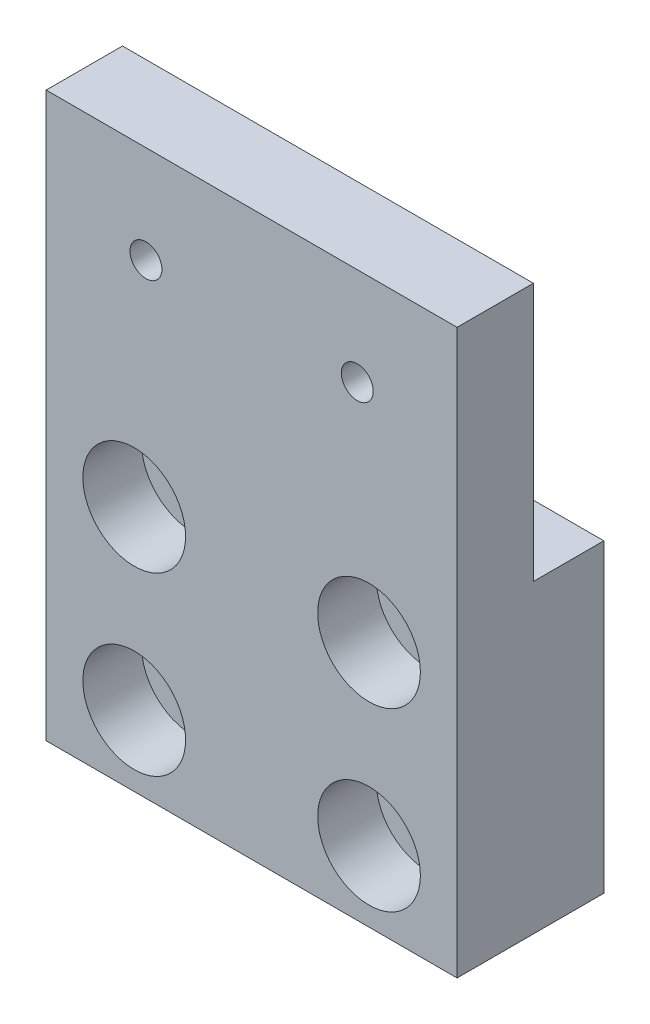
ISO-10303-21;
HEADER;
FILE_DESCRIPTION(('STEP AP214'),'2;1');
FILE_NAME('part.step','',(''),(''),'','','');
FILE_SCHEMA(('AUTOMOTIVE_DESIGN { 1 0 10303 214 1 1 1 1 }'));
ENDSEC;
DATA;
#1=APPLICATION_CONTEXT('core data for automotive mechanical design processes');
#2=APPLICATION_PROTOCOL_DEFINITION('international standard','automotive_design',2000,#1);
#3=PRODUCT_CONTEXT('',#1,'mechanical');
#4=PRODUCT('Part','Part','',(#3));
#5=PRODUCT_RELATED_PRODUCT_CATEGORY('part','',(#4));
#6=PRODUCT_DEFINITION_FORMATION('','',#4);
#7=PRODUCT_DEFINITION_CONTEXT('part definition',#1,'design');
#8=PRODUCT_DEFINITION('design','',#6,#7);
#9=PRODUCT_DEFINITION_SHAPE('','',#8);
#10=(LENGTH_UNIT() NAMED_UNIT(*) SI_UNIT(.MILLI.,.METRE.));
#11=(NAMED_UNIT(*) PLANE_ANGLE_UNIT() SI_UNIT($,.RADIAN.));
#12=(NAMED_UNIT(*) SI_UNIT($,.STERADIAN.) SOLID_ANGLE_UNIT());
#13=UNCERTAINTY_MEASURE_WITH_UNIT(LENGTH_MEASURE(1.E-05),#10,'distance_accuracy_value','');
#14=(GEOMETRIC_REPRESENTATION_CONTEXT(3) GLOBAL_UNCERTAINTY_ASSIGNED_CONTEXT((#13)) GLOBAL_UNIT_ASSIGNED_CONTEXT((#10,
#11,#12)) REPRESENTATION_CONTEXT('',''));
#15=CARTESIAN_POINT('',(0.,0.,0.));
#16=DIRECTION('',(0.,0.,1.));
#17=DIRECTION('',(1.,0.,0.));
#18=AXIS2_PLACEMENT_3D('',#15,#16,#17);
#19=CARTESIAN_POINT('',(-22.225,30.48,7.9375));
#20=DIRECTION('',(1.,0.,0.));
#21=DIRECTION('',(0.,1.,0.));
#22=AXIS2_PLACEMENT_3D('',#19,#20,#21);
#23=PLANE('',#22);
#24=DIRECTION('',(0.,-1.,0.));
#25=VECTOR('',#24,1.);
#26=CARTESIAN_POINT('',(-22.225,30.48,-0.317500000000002));
#27=LINE('',#26,#25);
#28=CARTESIAN_POINT('',(-22.225,30.48,-0.317500000000002));
#29=VERTEX_POINT('',#28);
#30=CARTESIAN_POINT('',(-22.225,2.53999999999998,-0.317500000000006));
#31=VERTEX_POINT('',#30);
#32=EDGE_CURVE('E94',#29,#31,#27,.T.);
#33=ORIENTED_EDGE('',*,*,#32,.T.);
#34=DIRECTION('',(0.,0.,-1.));
#35=VECTOR('',#34,1.);
#36=CARTESIAN_POINT('',(-22.225,2.53999999999998,-7.93750000000001));
#37=LINE('',#36,#35);
#38=CARTESIAN_POINT('',(-22.225,2.53999999999998,-7.93750000000001));
#39=VERTEX_POINT('',#38);
#40=EDGE_CURVE('E105',#31,#39,#37,.T.);
#41=ORIENTED_EDGE('',*,*,#40,.T.);
#42=DIRECTION('',(0.,-1.,0.));
#43=VECTOR('',#42,1.);
#44=CARTESIAN_POINT('',(-22.225,30.48,-7.9375));
#45=LINE('',#44,#43);
#46=CARTESIAN_POINT('',(-22.225,-30.48,-7.9375));
#47=VERTEX_POINT('',#46);
#48=EDGE_CURVE('E193',#39,#47,#45,.T.);
#49=ORIENTED_EDGE('',*,*,#48,.T.);
#50=DIRECTION('',(0.,0.,-1.));
#51=VECTOR('',#50,1.);
#52=CARTESIAN_POINT('',(-22.225,-30.48,7.9375));
#53=LINE('',#52,#51);
#54=CARTESIAN_POINT('',(-22.225,-30.48,7.9375));
#55=VERTEX_POINT('',#54);
#56=EDGE_CURVE('E11',#55,#47,#53,.T.);
#57=ORIENTED_EDGE('',*,*,#56,.F.);
#58=DIRECTION('',(0.,-1.,0.));
#59=VECTOR('',#58,1.);
#60=CARTESIAN_POINT('',(-22.225,30.48,7.9375));
#61=LINE('',#60,#59);
#62=CARTESIAN_POINT('',(-22.225,30.48,7.9375));
#63=VERTEX_POINT('',#62);
#64=EDGE_CURVE('E116',#63,#55,#61,.T.);
#65=ORIENTED_EDGE('',*,*,#64,.F.);
#66=DIRECTION('',(0.,0.,-1.));
#67=VECTOR('',#66,1.);
#68=CARTESIAN_POINT('',(-22.225,30.48,7.9375));
#69=LINE('',#68,#67);
#70=EDGE_CURVE('E110',#63,#29,#69,.T.);
#71=ORIENTED_EDGE('',*,*,#70,.T.);
#72=EDGE_LOOP('',(#33,#41,#49,#57,#65,#71));
#73=FACE_BOUND('',#72,.T.);
#74=ADVANCED_FACE('F34',(#73),#23,.F.);
#75=CARTESIAN_POINT('',(-22.225,-30.48,7.9375));
#76=DIRECTION('',(0.,1.,0.));
#77=DIRECTION('',(0.,0.,1.));
#78=AXIS2_PLACEMENT_3D('',#75,#76,#77);
#79=PLANE('',#78);
#80=DIRECTION('',(1.,0.,0.));
#81=VECTOR('',#80,1.);
#82=CARTESIAN_POINT('',(-22.225,-30.48,-7.9375));
#83=LINE('',#82,#81);
#84=CARTESIAN_POINT('',(22.225,-30.48,-7.9375));
#85=VERTEX_POINT('',#84);
#86=EDGE_CURVE('E74',#47,#85,#83,.T.);
#87=ORIENTED_EDGE('',*,*,#86,.T.);
#88=DIRECTION('',(0.,0.,-1.));
#89=VECTOR('',#88,1.);
#90=CARTESIAN_POINT('',(22.225,-30.48,7.9375));
#91=LINE('',#90,#89);
#92=CARTESIAN_POINT('',(22.225,-30.48,7.9375));
#93=VERTEX_POINT('',#92);
#94=EDGE_CURVE('E42',#93,#85,#91,.T.);
#95=ORIENTED_EDGE('',*,*,#94,.F.);
#96=DIRECTION('',(1.,0.,0.));
#97=VECTOR('',#96,1.);
#98=CARTESIAN_POINT('',(-22.225,-30.48,7.9375));
#99=LINE('',#98,#97);
#100=EDGE_CURVE('E79',#55,#93,#99,.T.);
#101=ORIENTED_EDGE('',*,*,#100,.F.);
#102=ORIENTED_EDGE('',*,*,#56,.T.);
#103=EDGE_LOOP('',(#87,#95,#101,#102));
#104=FACE_BOUND('',#103,.T.);
#105=ADVANCED_FACE('F206',(#104),#79,.F.);
#106=CARTESIAN_POINT('',(22.225,30.48,7.9375));
#107=DIRECTION('',(-1.,0.,0.));
#108=DIRECTION('',(0.,-1.,0.));
#109=AXIS2_PLACEMENT_3D('',#106,#107,#108);
#110=PLANE('',#109);
#111=DIRECTION('',(0.,1.,0.));
#112=VECTOR('',#111,1.);
#113=CARTESIAN_POINT('',(22.225,30.48,-7.9375));
#114=LINE('',#113,#112);
#115=CARTESIAN_POINT('',(22.225,2.54,-7.9375));
#116=VERTEX_POINT('',#115);
#117=EDGE_CURVE('E122',#85,#116,#114,.T.);
#118=ORIENTED_EDGE('',*,*,#117,.T.);
#119=DIRECTION('',(0.,0.,-1.));
#120=VECTOR('',#119,1.);
#121=CARTESIAN_POINT('',(22.225,2.53999999999999,-7.93750000000001));
#122=LINE('',#121,#120);
#123=CARTESIAN_POINT('',(22.225,2.53999999999999,-0.317500000000006));
#124=VERTEX_POINT('',#123);
#125=EDGE_CURVE('E50',#124,#116,#122,.T.);
#126=ORIENTED_EDGE('',*,*,#125,.F.);
#127=DIRECTION('',(0.,-1.,0.));
#128=VECTOR('',#127,1.);
#129=CARTESIAN_POINT('',(22.225,30.48,-0.317500000000002));
#130=LINE('',#129,#128);
#131=CARTESIAN_POINT('',(22.225,30.48,-0.317500000000002));
#132=VERTEX_POINT('',#131);
#133=EDGE_CURVE('E127',#132,#124,#130,.T.);
#134=ORIENTED_EDGE('',*,*,#133,.F.);
#135=DIRECTION('',(0.,0.,-1.));
#136=VECTOR('',#135,1.);
#137=CARTESIAN_POINT('',(22.225,30.48,7.9375));
#138=LINE('',#137,#136);
#139=CARTESIAN_POINT('',(22.225,30.48,7.9375));
#140=VERTEX_POINT('',#139);
#141=EDGE_CURVE('E113',#140,#132,#138,.T.);
#142=ORIENTED_EDGE('',*,*,#141,.F.);
#143=DIRECTION('',(0.,1.,0.));
#144=VECTOR('',#143,1.);
#145=CARTESIAN_POINT('',(22.225,30.48,7.9375));
#146=LINE('',#145,#144);
#147=EDGE_CURVE('E119',#93,#140,#146,.T.);
#148=ORIENTED_EDGE('',*,*,#147,.F.);
#149=ORIENTED_EDGE('',*,*,#94,.T.);
#150=EDGE_LOOP('',(#118,#126,#134,#142,#148,#149));
#151=FACE_BOUND('',#150,.T.);
#152=ADVANCED_FACE('F200',(#151),#110,.F.);
#153=CARTESIAN_POINT('',(-22.225,30.48,7.9375));
#154=DIRECTION('',(0.,-1.,0.));
#155=DIRECTION('',(0.,0.,-1.));
#156=AXIS2_PLACEMENT_3D('',#153,#154,#155);
#157=PLANE('',#156);
#158=ORIENTED_EDGE('',*,*,#141,.T.);
#159=DIRECTION('',(1.,0.,0.));
#160=VECTOR('',#159,1.);
#161=CARTESIAN_POINT('',(-22.225,30.48,-0.317500000000002));
#162=LINE('',#161,#160);
#163=EDGE_CURVE('E98',#29,#132,#162,.T.);
#164=ORIENTED_EDGE('',*,*,#163,.F.);
#165=ORIENTED_EDGE('',*,*,#70,.F.);
#166=DIRECTION('',(-1.,0.,0.));
#167=VECTOR('',#166,1.);
#168=CARTESIAN_POINT('',(-22.225,30.48,7.9375));
#169=LINE('',#168,#167);
#170=EDGE_CURVE('E59',#140,#63,#169,.T.);
#171=ORIENTED_EDGE('',*,*,#170,.F.);
#172=EDGE_LOOP('',(#158,#164,#165,#171));
#173=FACE_BOUND('',#172,.T.);
#174=ADVANCED_FACE('F109',(#173),#157,.F.);
#175=CARTESIAN_POINT('',(0.,0.,7.9375));
#176=DIRECTION('',(0.,0.,1.));
#177=DIRECTION('',(1.,0.,0.));
#178=AXIS2_PLACEMENT_3D('',#175,#176,#177);
#179=PLANE('',#178);
#180=CARTESIAN_POINT('',(-11.43,19.939,7.9375));
#181=DIRECTION('',(0.,0.,1.));
#182=DIRECTION('',(1.,0.,0.));
#183=AXIS2_PLACEMENT_3D('',#180,#181,#182);
#184=CIRCLE('',#183,1.72719999999999);
#185=CARTESIAN_POINT('',(-9.70280000000001,19.939,7.9375));
#186=VERTEX_POINT('',#185);
#187=EDGE_CURVE('E137',#186,#186,#184,.T.);
#188=ORIENTED_EDGE('',*,*,#187,.F.);
#189=EDGE_LOOP('',(#188));
#190=FACE_BOUND('',#189,.T.);
#191=CARTESIAN_POINT('',(11.43,19.939,7.9375));
#192=DIRECTION('',(0.,0.,1.));
#193=DIRECTION('',(1.,0.,0.));
#194=AXIS2_PLACEMENT_3D('',#191,#192,#193);
#195=CIRCLE('',#194,1.72719999999999);
#196=CARTESIAN_POINT('',(13.1572,19.939,7.9375));
#197=VERTEX_POINT('',#196);
#198=EDGE_CURVE('E128',#197,#197,#195,.T.);
#199=ORIENTED_EDGE('',*,*,#198,.F.);
#200=EDGE_LOOP('',(#199));
#201=FACE_BOUND('',#200,.T.);
#202=CARTESIAN_POINT('',(-12.7,-3.81,7.9375));
#203=DIRECTION('',(0.,0.,1.));
#204=DIRECTION('',(1.,0.,0.));
#205=AXIS2_PLACEMENT_3D('',#202,#203,#204);
#206=CIRCLE('',#205,5.55625);
#207=CARTESIAN_POINT('',(-7.14375,-3.81,7.9375));
#208=VERTEX_POINT('',#207);
#209=EDGE_CURVE('E144',#208,#208,#206,.T.);
#210=ORIENTED_EDGE('',*,*,#209,.F.);
#211=EDGE_LOOP('',(#210));
#212=FACE_BOUND('',#211,.T.);
#213=CARTESIAN_POINT('',(12.7,-3.81,7.9375));
#214=DIRECTION('',(0.,0.,1.));
#215=DIRECTION('',(1.,0.,0.));
#216=AXIS2_PLACEMENT_3D('',#213,#214,#215);
#217=CIRCLE('',#216,5.55625);
#218=CARTESIAN_POINT('',(18.25625,-3.81,7.9375));
#219=VERTEX_POINT('',#218);
#220=EDGE_CURVE('E157',#219,#219,#217,.T.);
#221=ORIENTED_EDGE('',*,*,#220,.F.);
#222=EDGE_LOOP('',(#221));
#223=FACE_BOUND('',#222,.T.);
#224=CARTESIAN_POINT('',(12.7,-22.86,7.9375));
#225=DIRECTION('',(0.,0.,1.));
#226=DIRECTION('',(1.,0.,0.));
#227=AXIS2_PLACEMENT_3D('',#224,#225,#226);
#228=CIRCLE('',#227,5.55625);
#229=CARTESIAN_POINT('',(18.25625,-22.86,7.9375));
#230=VERTEX_POINT('',#229);
#231=EDGE_CURVE('E169',#230,#230,#228,.T.);
#232=ORIENTED_EDGE('',*,*,#231,.F.);
#233=EDGE_LOOP('',(#232));
#234=FACE_BOUND('',#233,.T.);
#235=CARTESIAN_POINT('',(-12.7,-22.86,7.9375));
#236=DIRECTION('',(0.,0.,1.));
#237=DIRECTION('',(1.,0.,0.));
#238=AXIS2_PLACEMENT_3D('',#235,#236,#237);
#239=CIRCLE('',#238,5.55625);
#240=CARTESIAN_POINT('',(-7.14375,-22.86,7.9375));
#241=VERTEX_POINT('',#240);
#242=EDGE_CURVE('E181',#241,#241,#239,.T.);
#243=ORIENTED_EDGE('',*,*,#242,.F.);
#244=EDGE_LOOP('',(#243));
#245=FACE_BOUND('',#244,.T.);
#246=ORIENTED_EDGE('',*,*,#64,.T.);
#247=ORIENTED_EDGE('',*,*,#100,.T.);
#248=ORIENTED_EDGE('',*,*,#147,.T.);
#249=ORIENTED_EDGE('',*,*,#170,.T.);
#250=EDGE_LOOP('',(#246,#247,#248,#249));
#251=FACE_BOUND('',#250,.T.);
#252=ADVANCED_FACE('F216',(#190,#201,#212,#223,#234,#245,#251),#179,.T.);
#253=CARTESIAN_POINT('',(0.,0.,-7.9375));
#254=DIRECTION('',(0.,0.,1.));
#255=DIRECTION('',(1.,0.,0.));
#256=AXIS2_PLACEMENT_3D('',#253,#254,#255);
#257=PLANE('',#256);
#258=CARTESIAN_POINT('',(-12.7,-3.81,-7.9375));
#259=DIRECTION('',(0.,0.,1.));
#260=DIRECTION('',(1.,0.,0.));
#261=AXIS2_PLACEMENT_3D('',#258,#259,#260);
#262=CIRCLE('',#261,3.3782);
#263=CARTESIAN_POINT('',(-9.3218,-3.81,-7.9375));
#264=VERTEX_POINT('',#263);
#265=EDGE_CURVE('E154',#264,#264,#262,.T.);
#266=ORIENTED_EDGE('',*,*,#265,.T.);
#267=EDGE_LOOP('',(#266));
#268=FACE_BOUND('',#267,.T.);
#269=CARTESIAN_POINT('',(12.7,-3.81,-7.9375));
#270=DIRECTION('',(0.,0.,1.));
#271=DIRECTION('',(1.,0.,0.));
#272=AXIS2_PLACEMENT_3D('',#269,#270,#271);
#273=CIRCLE('',#272,3.3782);
#274=CARTESIAN_POINT('',(16.0782,-3.81,-7.9375));
#275=VERTEX_POINT('',#274);
#276=EDGE_CURVE('E166',#275,#275,#273,.T.);
#277=ORIENTED_EDGE('',*,*,#276,.T.);
#278=EDGE_LOOP('',(#277));
#279=FACE_BOUND('',#278,.T.);
#280=CARTESIAN_POINT('',(12.7,-22.86,-7.9375));
#281=DIRECTION('',(0.,0.,1.));
#282=DIRECTION('',(1.,0.,0.));
#283=AXIS2_PLACEMENT_3D('',#280,#281,#282);
#284=CIRCLE('',#283,3.3782);
#285=CARTESIAN_POINT('',(16.0782,-22.86,-7.9375));
#286=VERTEX_POINT('',#285);
#287=EDGE_CURVE('E178',#286,#286,#284,.T.);
#288=ORIENTED_EDGE('',*,*,#287,.T.);
#289=EDGE_LOOP('',(#288));
#290=FACE_BOUND('',#289,.T.);
#291=CARTESIAN_POINT('',(-12.7,-22.86,-7.9375));
#292=DIRECTION('',(0.,0.,1.));
#293=DIRECTION('',(1.,0.,0.));
#294=AXIS2_PLACEMENT_3D('',#291,#292,#293);
#295=CIRCLE('',#294,3.3782);
#296=CARTESIAN_POINT('',(-9.32179999999999,-22.86,-7.9375));
#297=VERTEX_POINT('',#296);
#298=EDGE_CURVE('E190',#297,#297,#295,.T.);
#299=ORIENTED_EDGE('',*,*,#298,.T.);
#300=EDGE_LOOP('',(#299));
#301=FACE_BOUND('',#300,.T.);
#302=ORIENTED_EDGE('',*,*,#48,.F.);
#303=DIRECTION('',(1.,0.,0.));
#304=VECTOR('',#303,1.);
#305=CARTESIAN_POINT('',(-22.225,2.53999999999998,-7.93750000000001));
#306=LINE('',#305,#304);
#307=EDGE_CURVE('E142',#39,#116,#306,.T.);
#308=ORIENTED_EDGE('',*,*,#307,.T.);
#309=ORIENTED_EDGE('',*,*,#117,.F.);
#310=ORIENTED_EDGE('',*,*,#86,.F.);
#311=EDGE_LOOP('',(#302,#308,#309,#310));
#312=FACE_BOUND('',#311,.T.);
#313=ADVANCED_FACE('F204',(#268,#279,#290,#301,#312),#257,.F.);
#314=CARTESIAN_POINT('',(-12.7,-22.86,7.9375));
#315=DIRECTION('',(0.,0.,1.));
#316=DIRECTION('',(1.,0.,0.));
#317=AXIS2_PLACEMENT_3D('',#314,#315,#316);
#318=CYLINDRICAL_SURFACE('',#317,3.3782);
#319=ORIENTED_EDGE('',*,*,#298,.F.);
#320=EDGE_LOOP('',(#319));
#321=FACE_BOUND('',#320,.T.);
#322=CARTESIAN_POINT('',(-12.7,-22.86,1.5875));
#323=DIRECTION('',(0.,0.,1.));
#324=DIRECTION('',(1.,0.,0.));
#325=AXIS2_PLACEMENT_3D('',#322,#323,#324);
#326=CIRCLE('',#325,3.37820000000001);
#327=CARTESIAN_POINT('',(-9.32179999999999,-22.86,1.5875));
#328=VERTEX_POINT('',#327);
#329=EDGE_CURVE('E187',#328,#328,#326,.T.);
#330=ORIENTED_EDGE('',*,*,#329,.T.);
#331=EDGE_LOOP('',(#330));
#332=FACE_BOUND('',#331,.T.);
#333=ADVANCED_FACE('F219',(#321,#332),#318,.F.);
#334=CARTESIAN_POINT('',(-9.32179999999999,-22.86,1.5875));
#335=DIRECTION('',(0.,0.,-1.));
#336=DIRECTION('',(-1.,0.,0.));
#337=AXIS2_PLACEMENT_3D('',#334,#335,#336);
#338=PLANE('',#337);
#339=ORIENTED_EDGE('',*,*,#329,.F.);
#340=EDGE_LOOP('',(#339));
#341=FACE_BOUND('',#340,.T.);
#342=CARTESIAN_POINT('',(-12.7,-22.86,1.5875));
#343=DIRECTION('',(0.,0.,1.));
#344=DIRECTION('',(1.,0.,0.));
#345=AXIS2_PLACEMENT_3D('',#342,#343,#344);
#346=CIRCLE('',#345,5.55625);
#347=CARTESIAN_POINT('',(-7.14375,-22.86,1.5875));
#348=VERTEX_POINT('',#347);
#349=EDGE_CURVE('E184',#348,#348,#346,.T.);
#350=ORIENTED_EDGE('',*,*,#349,.T.);
#351=EDGE_LOOP('',(#350));
#352=FACE_BOUND('',#351,.T.);
#353=ADVANCED_FACE('F226',(#341,#352),#338,.F.);
#354=CARTESIAN_POINT('',(-12.7,-22.86,7.9375));
#355=DIRECTION('',(0.,0.,1.));
#356=DIRECTION('',(1.,0.,0.));
#357=AXIS2_PLACEMENT_3D('',#354,#355,#356);
#358=CYLINDRICAL_SURFACE('',#357,5.55625);
#359=ORIENTED_EDGE('',*,*,#349,.F.);
#360=EDGE_LOOP('',(#359));
#361=FACE_BOUND('',#360,.T.);
#362=ORIENTED_EDGE('',*,*,#242,.T.);
#363=EDGE_LOOP('',(#362));
#364=FACE_BOUND('',#363,.T.);
#365=ADVANCED_FACE('F230',(#361,#364),#358,.F.);
#366=CARTESIAN_POINT('',(12.7,-22.86,7.9375));
#367=DIRECTION('',(0.,0.,1.));
#368=DIRECTION('',(1.,0.,0.));
#369=AXIS2_PLACEMENT_3D('',#366,#367,#368);
#370=CYLINDRICAL_SURFACE('',#369,3.37820000000001);
#371=ORIENTED_EDGE('',*,*,#287,.F.);
#372=EDGE_LOOP('',(#371));
#373=FACE_BOUND('',#372,.T.);
#374=CARTESIAN_POINT('',(12.7,-22.86,1.5875));
#375=DIRECTION('',(0.,0.,1.));
#376=DIRECTION('',(1.,0.,0.));
#377=AXIS2_PLACEMENT_3D('',#374,#375,#376);
#378=CIRCLE('',#377,3.37820000000001);
#379=CARTESIAN_POINT('',(16.0782,-22.86,1.5875));
#380=VERTEX_POINT('',#379);
#381=EDGE_CURVE('E175',#380,#380,#378,.T.);
#382=ORIENTED_EDGE('',*,*,#381,.T.);
#383=EDGE_LOOP('',(#382));
#384=FACE_BOUND('',#383,.T.);
#385=ADVANCED_FACE('F234',(#373,#384),#370,.F.);
#386=CARTESIAN_POINT('',(16.0782,-22.86,1.5875));
#387=DIRECTION('',(0.,0.,-1.));
#388=DIRECTION('',(-1.,0.,0.));
#389=AXIS2_PLACEMENT_3D('',#386,#387,#388);
#390=PLANE('',#389);
#391=ORIENTED_EDGE('',*,*,#381,.F.);
#392=EDGE_LOOP('',(#391));
#393=FACE_BOUND('',#392,.T.);
#394=CARTESIAN_POINT('',(12.7,-22.86,1.5875));
#395=DIRECTION('',(0.,0.,1.));
#396=DIRECTION('',(1.,0.,0.));
#397=AXIS2_PLACEMENT_3D('',#394,#395,#396);
#398=CIRCLE('',#397,5.55625);
#399=CARTESIAN_POINT('',(18.25625,-22.86,1.5875));
#400=VERTEX_POINT('',#399);
#401=EDGE_CURVE('E172',#400,#400,#398,.T.);
#402=ORIENTED_EDGE('',*,*,#401,.T.);
#403=EDGE_LOOP('',(#402));
#404=FACE_BOUND('',#403,.T.);
#405=ADVANCED_FACE('F238',(#393,#404),#390,.F.);
#406=CARTESIAN_POINT('',(12.7,-22.86,7.9375));
#407=DIRECTION('',(0.,0.,1.));
#408=DIRECTION('',(1.,0.,0.));
#409=AXIS2_PLACEMENT_3D('',#406,#407,#408);
#410=CYLINDRICAL_SURFACE('',#409,5.55625);
#411=ORIENTED_EDGE('',*,*,#401,.F.);
#412=EDGE_LOOP('',(#411));
#413=FACE_BOUND('',#412,.T.);
#414=ORIENTED_EDGE('',*,*,#231,.T.);
#415=EDGE_LOOP('',(#414));
#416=FACE_BOUND('',#415,.T.);
#417=ADVANCED_FACE('F242',(#413,#416),#410,.F.);
#418=CARTESIAN_POINT('',(12.7,-3.81,7.9375));
#419=DIRECTION('',(0.,0.,1.));
#420=DIRECTION('',(1.,0.,0.));
#421=AXIS2_PLACEMENT_3D('',#418,#419,#420);
#422=CYLINDRICAL_SURFACE('',#421,3.37820000000001);
#423=ORIENTED_EDGE('',*,*,#276,.F.);
#424=EDGE_LOOP('',(#423));
#425=FACE_BOUND('',#424,.T.);
#426=CARTESIAN_POINT('',(12.7,-3.81,1.5875));
#427=DIRECTION('',(0.,0.,1.));
#428=DIRECTION('',(1.,0.,0.));
#429=AXIS2_PLACEMENT_3D('',#426,#427,#428);
#430=CIRCLE('',#429,3.37820000000001);
#431=CARTESIAN_POINT('',(16.0782,-3.81,1.5875));
#432=VERTEX_POINT('',#431);
#433=EDGE_CURVE('E163',#432,#432,#430,.T.);
#434=ORIENTED_EDGE('',*,*,#433,.T.);
#435=EDGE_LOOP('',(#434));
#436=FACE_BOUND('',#435,.T.);
#437=ADVANCED_FACE('F246',(#425,#436),#422,.F.);
#438=CARTESIAN_POINT('',(16.0782,-3.81,1.5875));
#439=DIRECTION('',(0.,0.,-1.));
#440=DIRECTION('',(-1.,0.,0.));
#441=AXIS2_PLACEMENT_3D('',#438,#439,#440);
#442=PLANE('',#441);
#443=ORIENTED_EDGE('',*,*,#433,.F.);
#444=EDGE_LOOP('',(#443));
#445=FACE_BOUND('',#444,.T.);
#446=CARTESIAN_POINT('',(12.7,-3.81,1.5875));
#447=DIRECTION('',(0.,0.,1.));
#448=DIRECTION('',(1.,0.,0.));
#449=AXIS2_PLACEMENT_3D('',#446,#447,#448);
#450=CIRCLE('',#449,5.55625);
#451=CARTESIAN_POINT('',(18.25625,-3.81,1.5875));
#452=VERTEX_POINT('',#451);
#453=EDGE_CURVE('E160',#452,#452,#450,.T.);
#454=ORIENTED_EDGE('',*,*,#453,.T.);
#455=EDGE_LOOP('',(#454));
#456=FACE_BOUND('',#455,.T.);
#457=ADVANCED_FACE('F250',(#445,#456),#442,.F.);
#458=CARTESIAN_POINT('',(12.7,-3.81,7.9375));
#459=DIRECTION('',(0.,0.,1.));
#460=DIRECTION('',(1.,0.,0.));
#461=AXIS2_PLACEMENT_3D('',#458,#459,#460);
#462=CYLINDRICAL_SURFACE('',#461,5.55625);
#463=ORIENTED_EDGE('',*,*,#453,.F.);
#464=EDGE_LOOP('',(#463));
#465=FACE_BOUND('',#464,.T.);
#466=ORIENTED_EDGE('',*,*,#220,.T.);
#467=EDGE_LOOP('',(#466));
#468=FACE_BOUND('',#467,.T.);
#469=ADVANCED_FACE('F254',(#465,#468),#462,.F.);
#470=CARTESIAN_POINT('',(-12.7,-3.81,7.9375));
#471=DIRECTION('',(0.,0.,1.));
#472=DIRECTION('',(1.,0.,0.));
#473=AXIS2_PLACEMENT_3D('',#470,#471,#472);
#474=CYLINDRICAL_SURFACE('',#473,3.3782);
#475=ORIENTED_EDGE('',*,*,#265,.F.);
#476=EDGE_LOOP('',(#475));
#477=FACE_BOUND('',#476,.T.);
#478=CARTESIAN_POINT('',(-12.7,-3.81,1.5875));
#479=DIRECTION('',(0.,0.,1.));
#480=DIRECTION('',(1.,0.,0.));
#481=AXIS2_PLACEMENT_3D('',#478,#479,#480);
#482=CIRCLE('',#481,3.37820000000001);
#483=CARTESIAN_POINT('',(-9.32179999999999,-3.81,1.5875));
#484=VERTEX_POINT('',#483);
#485=EDGE_CURVE('E151',#484,#484,#482,.T.);
#486=ORIENTED_EDGE('',*,*,#485,.T.);
#487=EDGE_LOOP('',(#486));
#488=FACE_BOUND('',#487,.T.);
#489=ADVANCED_FACE('F258',(#477,#488),#474,.F.);
#490=CARTESIAN_POINT('',(-9.32179999999999,-3.81,1.5875));
#491=DIRECTION('',(0.,0.,-1.));
#492=DIRECTION('',(-1.,0.,0.));
#493=AXIS2_PLACEMENT_3D('',#490,#491,#492);
#494=PLANE('',#493);
#495=ORIENTED_EDGE('',*,*,#485,.F.);
#496=EDGE_LOOP('',(#495));
#497=FACE_BOUND('',#496,.T.);
#498=CARTESIAN_POINT('',(-12.7,-3.81,1.5875));
#499=DIRECTION('',(0.,0.,1.));
#500=DIRECTION('',(1.,0.,0.));
#501=AXIS2_PLACEMENT_3D('',#498,#499,#500);
#502=CIRCLE('',#501,5.55625);
#503=CARTESIAN_POINT('',(-7.14375,-3.81,1.5875));
#504=VERTEX_POINT('',#503);
#505=EDGE_CURVE('E148',#504,#504,#502,.T.);
#506=ORIENTED_EDGE('',*,*,#505,.T.);
#507=EDGE_LOOP('',(#506));
#508=FACE_BOUND('',#507,.T.);
#509=ADVANCED_FACE('F262',(#497,#508),#494,.F.);
#510=CARTESIAN_POINT('',(-12.7,-3.81,7.9375));
#511=DIRECTION('',(0.,0.,1.));
#512=DIRECTION('',(1.,0.,0.));
#513=AXIS2_PLACEMENT_3D('',#510,#511,#512);
#514=CYLINDRICAL_SURFACE('',#513,5.55625);
#515=ORIENTED_EDGE('',*,*,#505,.F.);
#516=EDGE_LOOP('',(#515));
#517=FACE_BOUND('',#516,.T.);
#518=ORIENTED_EDGE('',*,*,#209,.T.);
#519=EDGE_LOOP('',(#518));
#520=FACE_BOUND('',#519,.T.);
#521=ADVANCED_FACE('F266',(#517,#520),#514,.F.);
#522=CARTESIAN_POINT('',(-22.225,2.53999999999998,-7.93750000000001));
#523=DIRECTION('',(0.,-1.,0.));
#524=DIRECTION('',(1.,0.,0.));
#525=AXIS2_PLACEMENT_3D('',#522,#523,#524);
#526=PLANE('',#525);
#527=ORIENTED_EDGE('',*,*,#125,.T.);
#528=ORIENTED_EDGE('',*,*,#307,.F.);
#529=ORIENTED_EDGE('',*,*,#40,.F.);
#530=DIRECTION('',(1.,0.,0.));
#531=VECTOR('',#530,1.);
#532=CARTESIAN_POINT('',(-22.225,2.53999999999998,-0.317500000000006));
#533=LINE('',#532,#531);
#534=EDGE_CURVE('E100',#31,#124,#533,.T.);
#535=ORIENTED_EDGE('',*,*,#534,.T.);
#536=EDGE_LOOP('',(#527,#528,#529,#535));
#537=FACE_BOUND('',#536,.T.);
#538=ADVANCED_FACE('F205',(#537),#526,.F.);
#539=CARTESIAN_POINT('',(-22.225,30.48,-0.317500000000002));
#540=DIRECTION('',(0.,0.,1.));
#541=DIRECTION('',(0.,-1.,0.));
#542=AXIS2_PLACEMENT_3D('',#539,#540,#541);
#543=PLANE('',#542);
#544=CARTESIAN_POINT('',(-11.43,19.939,-0.317500000000004));
#545=DIRECTION('',(0.,0.,1.));
#546=DIRECTION('',(0.,-1.,0.));
#547=AXIS2_PLACEMENT_3D('',#544,#545,#546);
#548=CIRCLE('',#547,1.72719999999999);
#549=CARTESIAN_POINT('',(-11.43,18.2118,-0.317500000000004));
#550=VERTEX_POINT('',#549);
#551=EDGE_CURVE('E37',#550,#550,#548,.T.);
#552=ORIENTED_EDGE('',*,*,#551,.T.);
#553=EDGE_LOOP('',(#552));
#554=FACE_BOUND('',#553,.T.);
#555=CARTESIAN_POINT('',(11.43,19.939,-0.317500000000004));
#556=DIRECTION('',(0.,0.,1.));
#557=DIRECTION('',(0.,-1.,0.));
#558=AXIS2_PLACEMENT_3D('',#555,#556,#557);
#559=CIRCLE('',#558,1.72719999999999);
#560=CARTESIAN_POINT('',(11.43,18.2118,-0.317500000000004));
#561=VERTEX_POINT('',#560);
#562=EDGE_CURVE('E125',#561,#561,#559,.T.);
#563=ORIENTED_EDGE('',*,*,#562,.T.);
#564=EDGE_LOOP('',(#563));
#565=FACE_BOUND('',#564,.T.);
#566=ORIENTED_EDGE('',*,*,#133,.T.);
#567=ORIENTED_EDGE('',*,*,#534,.F.);
#568=ORIENTED_EDGE('',*,*,#32,.F.);
#569=ORIENTED_EDGE('',*,*,#163,.T.);
#570=EDGE_LOOP('',(#566,#567,#568,#569));
#571=FACE_BOUND('',#570,.T.);
#572=ADVANCED_FACE('F97',(#554,#565,#571),#543,.F.);
#573=CARTESIAN_POINT('',(11.43,19.939,7.9375));
#574=DIRECTION('',(0.,0.,1.));
#575=DIRECTION('',(1.,0.,0.));
#576=AXIS2_PLACEMENT_3D('',#573,#574,#575);
#577=CYLINDRICAL_SURFACE('',#576,1.72719999999999);
#578=ORIENTED_EDGE('',*,*,#198,.T.);
#579=EDGE_LOOP('',(#578));
#580=FACE_BOUND('',#579,.T.);
#581=ORIENTED_EDGE('',*,*,#562,.F.);
#582=EDGE_LOOP('',(#581));
#583=FACE_BOUND('',#582,.T.);
#584=ADVANCED_FACE('F273',(#580,#583),#577,.F.);
#585=CARTESIAN_POINT('',(-11.43,19.939,7.9375));
#586=DIRECTION('',(0.,0.,1.));
#587=DIRECTION('',(1.,0.,0.));
#588=AXIS2_PLACEMENT_3D('',#585,#586,#587);
#589=CYLINDRICAL_SURFACE('',#588,1.72719999999999);
#590=ORIENTED_EDGE('',*,*,#187,.T.);
#591=EDGE_LOOP('',(#590));
#592=FACE_BOUND('',#591,.T.);
#593=ORIENTED_EDGE('',*,*,#551,.F.);
#594=EDGE_LOOP('',(#593));
#595=FACE_BOUND('',#594,.T.);
#596=ADVANCED_FACE('F279',(#592,#595),#589,.F.);
#597=CLOSED_SHELL('',(#74,#105,#152,#174,#252,#313,#333,#353,#365,#385,#405,#417,#437,#457,#469,
#489,#509,#521,#538,#572,#584,#596));
#598=MANIFOLD_SOLID_BREP('B2',#597);
#599=ADVANCED_BREP_SHAPE_REPRESENTATION('',(#18,#598),#14);
#600=SHAPE_DEFINITION_REPRESENTATION(#9,#599);
ENDSEC;
END-ISO-10303-21;
